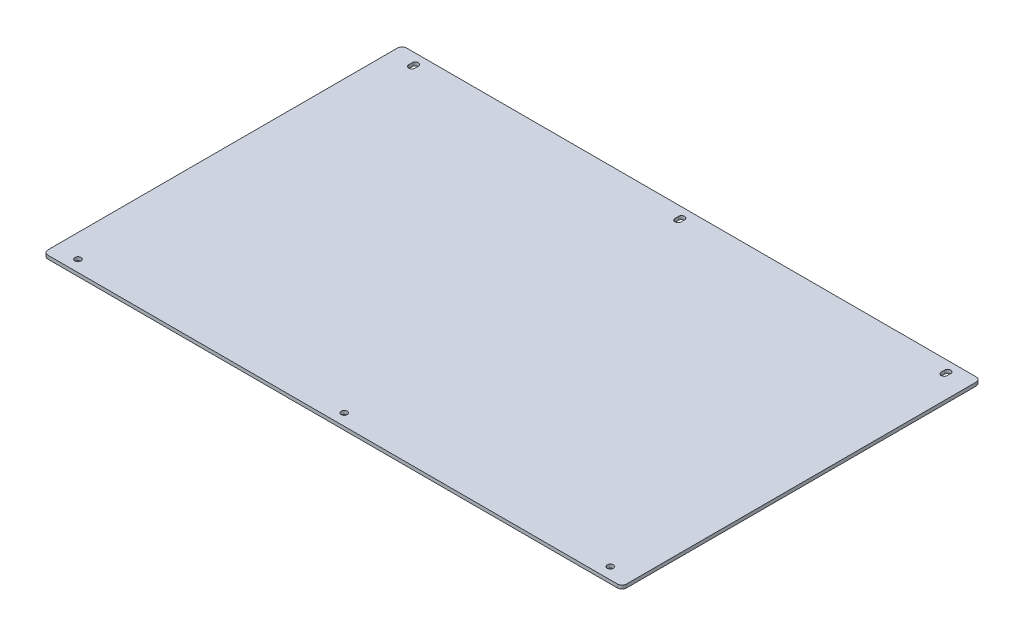
ISO-10303-21;
HEADER;
FILE_DESCRIPTION(('STEP AP214'),'2;1');
FILE_NAME('part.step','',(''),(''),'','','');
FILE_SCHEMA(('AUTOMOTIVE_DESIGN { 1 0 10303 214 1 1 1 1 }'));
ENDSEC;
DATA;
#1=APPLICATION_CONTEXT('core data for automotive mechanical design processes');
#2=APPLICATION_PROTOCOL_DEFINITION('international standard','automotive_design',2000,#1);
#3=PRODUCT_CONTEXT('',#1,'mechanical');
#4=PRODUCT('Part','Part','',(#3));
#5=PRODUCT_RELATED_PRODUCT_CATEGORY('part','',(#4));
#6=PRODUCT_DEFINITION_FORMATION('','',#4);
#7=PRODUCT_DEFINITION_CONTEXT('part definition',#1,'design');
#8=PRODUCT_DEFINITION('design','',#6,#7);
#9=PRODUCT_DEFINITION_SHAPE('','',#8);
#10=(LENGTH_UNIT() NAMED_UNIT(*) SI_UNIT(.MILLI.,.METRE.));
#11=(NAMED_UNIT(*) PLANE_ANGLE_UNIT() SI_UNIT($,.RADIAN.));
#12=(NAMED_UNIT(*) SI_UNIT($,.STERADIAN.) SOLID_ANGLE_UNIT());
#13=UNCERTAINTY_MEASURE_WITH_UNIT(LENGTH_MEASURE(1.E-05),#10,'distance_accuracy_value','');
#14=(GEOMETRIC_REPRESENTATION_CONTEXT(3) GLOBAL_UNCERTAINTY_ASSIGNED_CONTEXT((#13)) GLOBAL_UNIT_ASSIGNED_CONTEXT((#10,
#11,#12)) REPRESENTATION_CONTEXT('',''));
#15=CARTESIAN_POINT('',(0.,0.,0.));
#16=DIRECTION('',(0.,0.,1.));
#17=DIRECTION('',(1.,0.,0.));
#18=AXIS2_PLACEMENT_3D('',#15,#16,#17);
#19=CARTESIAN_POINT('',(250.,3.,155.));
#20=DIRECTION('',(-1.,0.,0.));
#21=DIRECTION('',(0.,0.,1.));
#22=AXIS2_PLACEMENT_3D('',#19,#20,#21);
#23=PLANE('',#22);
#24=DIRECTION('',(0.,0.,-1.));
#25=VECTOR('',#24,1.);
#26=CARTESIAN_POINT('',(250.,0.,155.));
#27=LINE('',#26,#25);
#28=CARTESIAN_POINT('',(250.,0.,151.));
#29=VERTEX_POINT('',#28);
#30=CARTESIAN_POINT('',(250.,0.,-151.));
#31=VERTEX_POINT('',#30);
#32=EDGE_CURVE('E292',#29,#31,#27,.T.);
#33=ORIENTED_EDGE('',*,*,#32,.T.);
#34=DIRECTION('',(0.,-1.,0.));
#35=VECTOR('',#34,1.);
#36=CARTESIAN_POINT('',(250.,3.,-151.));
#37=LINE('',#36,#35);
#38=CARTESIAN_POINT('',(250.,3.,-151.));
#39=VERTEX_POINT('',#38);
#40=EDGE_CURVE('E11',#31,#39,#37,.F.);
#41=ORIENTED_EDGE('',*,*,#40,.T.);
#42=DIRECTION('',(0.,0.,-1.));
#43=VECTOR('',#42,1.);
#44=CARTESIAN_POINT('',(250.,3.,155.));
#45=LINE('',#44,#43);
#46=CARTESIAN_POINT('',(250.,3.,151.));
#47=VERTEX_POINT('',#46);
#48=EDGE_CURVE('E293',#47,#39,#45,.T.);
#49=ORIENTED_EDGE('',*,*,#48,.F.);
#50=DIRECTION('',(0.,-1.,0.));
#51=VECTOR('',#50,1.);
#52=CARTESIAN_POINT('',(250.,3.,151.));
#53=LINE('',#52,#51);
#54=EDGE_CURVE('E41',#47,#29,#53,.T.);
#55=ORIENTED_EDGE('',*,*,#54,.T.);
#56=EDGE_LOOP('',(#33,#41,#49,#55));
#57=FACE_BOUND('',#56,.T.);
#58=ADVANCED_FACE('F33',(#57),#23,.F.);
#59=CARTESIAN_POINT('',(-250.,3.,-155.));
#60=DIRECTION('',(0.,0.,1.));
#61=DIRECTION('',(1.,0.,0.));
#62=AXIS2_PLACEMENT_3D('',#59,#60,#61);
#63=PLANE('',#62);
#64=DIRECTION('',(-1.,0.,0.));
#65=VECTOR('',#64,1.);
#66=CARTESIAN_POINT('',(-250.,0.,-155.));
#67=LINE('',#66,#65);
#68=CARTESIAN_POINT('',(246.,0.,-155.));
#69=VERTEX_POINT('',#68);
#70=CARTESIAN_POINT('',(-246.,0.,-155.));
#71=VERTEX_POINT('',#70);
#72=EDGE_CURVE('E309',#69,#71,#67,.T.);
#73=ORIENTED_EDGE('',*,*,#72,.T.);
#74=DIRECTION('',(0.,-1.,0.));
#75=VECTOR('',#74,1.);
#76=CARTESIAN_POINT('',(-246.,3.,-155.));
#77=LINE('',#76,#75);
#78=CARTESIAN_POINT('',(-246.,3.,-155.));
#79=VERTEX_POINT('',#78);
#80=EDGE_CURVE('E345',#71,#79,#77,.F.);
#81=ORIENTED_EDGE('',*,*,#80,.T.);
#82=DIRECTION('',(-1.,0.,0.));
#83=VECTOR('',#82,1.);
#84=CARTESIAN_POINT('',(-250.,3.,-155.));
#85=LINE('',#84,#83);
#86=CARTESIAN_POINT('',(246.,3.,-155.));
#87=VERTEX_POINT('',#86);
#88=EDGE_CURVE('E296',#87,#79,#85,.T.);
#89=ORIENTED_EDGE('',*,*,#88,.F.);
#90=DIRECTION('',(0.,-1.,0.));
#91=VECTOR('',#90,1.);
#92=CARTESIAN_POINT('',(246.,3.,-155.));
#93=LINE('',#92,#91);
#94=EDGE_CURVE('E342',#87,#69,#93,.T.);
#95=ORIENTED_EDGE('',*,*,#94,.T.);
#96=EDGE_LOOP('',(#73,#81,#89,#95));
#97=FACE_BOUND('',#96,.T.);
#98=ADVANCED_FACE('F363',(#97),#63,.F.);
#99=CARTESIAN_POINT('',(-250.,3.,155.));
#100=DIRECTION('',(1.,0.,0.));
#101=DIRECTION('',(0.,0.,-1.));
#102=AXIS2_PLACEMENT_3D('',#99,#100,#101);
#103=PLANE('',#102);
#104=DIRECTION('',(0.,0.,1.));
#105=VECTOR('',#104,1.);
#106=CARTESIAN_POINT('',(-250.,0.,155.));
#107=LINE('',#106,#105);
#108=CARTESIAN_POINT('',(-250.,0.,-151.));
#109=VERTEX_POINT('',#108);
#110=CARTESIAN_POINT('',(-250.,0.,151.));
#111=VERTEX_POINT('',#110);
#112=EDGE_CURVE('E312',#109,#111,#107,.T.);
#113=ORIENTED_EDGE('',*,*,#112,.T.);
#114=DIRECTION('',(0.,-1.,0.));
#115=VECTOR('',#114,1.);
#116=CARTESIAN_POINT('',(-250.,3.,151.));
#117=LINE('',#116,#115);
#118=CARTESIAN_POINT('',(-250.,3.,151.));
#119=VERTEX_POINT('',#118);
#120=EDGE_CURVE('E332',#111,#119,#117,.F.);
#121=ORIENTED_EDGE('',*,*,#120,.T.);
#122=DIRECTION('',(0.,0.,1.));
#123=VECTOR('',#122,1.);
#124=CARTESIAN_POINT('',(-250.,3.,155.));
#125=LINE('',#124,#123);
#126=CARTESIAN_POINT('',(-250.,3.,-151.));
#127=VERTEX_POINT('',#126);
#128=EDGE_CURVE('E300',#127,#119,#125,.T.);
#129=ORIENTED_EDGE('',*,*,#128,.F.);
#130=DIRECTION('',(0.,-1.,0.));
#131=VECTOR('',#130,1.);
#132=CARTESIAN_POINT('',(-250.,3.,-151.));
#133=LINE('',#132,#131);
#134=EDGE_CURVE('E329',#127,#109,#133,.T.);
#135=ORIENTED_EDGE('',*,*,#134,.T.);
#136=EDGE_LOOP('',(#113,#121,#129,#135));
#137=FACE_BOUND('',#136,.T.);
#138=ADVANCED_FACE('F374',(#137),#103,.F.);
#139=CARTESIAN_POINT('',(-250.,3.,155.));
#140=DIRECTION('',(0.,0.,-1.));
#141=DIRECTION('',(-1.,0.,0.));
#142=AXIS2_PLACEMENT_3D('',#139,#140,#141);
#143=PLANE('',#142);
#144=DIRECTION('',(1.,0.,0.));
#145=VECTOR('',#144,1.);
#146=CARTESIAN_POINT('',(-250.,3.,155.));
#147=LINE('',#146,#145);
#148=CARTESIAN_POINT('',(-246.,3.,155.));
#149=VERTEX_POINT('',#148);
#150=CARTESIAN_POINT('',(246.,3.,155.));
#151=VERTEX_POINT('',#150);
#152=EDGE_CURVE('E303',#149,#151,#147,.T.);
#153=ORIENTED_EDGE('',*,*,#152,.F.);
#154=DIRECTION('',(0.,-1.,0.));
#155=VECTOR('',#154,1.);
#156=CARTESIAN_POINT('',(-246.,3.,155.));
#157=LINE('',#156,#155);
#158=CARTESIAN_POINT('',(-246.,0.,155.));
#159=VERTEX_POINT('',#158);
#160=EDGE_CURVE('E318',#149,#159,#157,.T.);
#161=ORIENTED_EDGE('',*,*,#160,.T.);
#162=DIRECTION('',(1.,0.,0.));
#163=VECTOR('',#162,1.);
#164=CARTESIAN_POINT('',(-250.,0.,155.));
#165=LINE('',#164,#163);
#166=CARTESIAN_POINT('',(246.,0.,155.));
#167=VERTEX_POINT('',#166);
#168=EDGE_CURVE('E297',#159,#167,#165,.T.);
#169=ORIENTED_EDGE('',*,*,#168,.T.);
#170=DIRECTION('',(0.,-1.,0.));
#171=VECTOR('',#170,1.);
#172=CARTESIAN_POINT('',(246.,3.,155.));
#173=LINE('',#172,#171);
#174=EDGE_CURVE('E306',#167,#151,#173,.F.);
#175=ORIENTED_EDGE('',*,*,#174,.T.);
#176=EDGE_LOOP('',(#153,#161,#169,#175));
#177=FACE_BOUND('',#176,.T.);
#178=ADVANCED_FACE('F382',(#177),#143,.F.);
#179=CARTESIAN_POINT('',(0.,3.,0.));
#180=DIRECTION('',(0.,-1.,0.));
#181=DIRECTION('',(0.,0.,-1.));
#182=AXIS2_PLACEMENT_3D('',#179,#180,#181);
#183=PLANE('',#182);
#184=DIRECTION('',(0.,0.,-1.));
#185=VECTOR('',#184,1.);
#186=CARTESIAN_POINT('',(232.65,3.,-143.5));
#187=LINE('',#186,#185);
#188=CARTESIAN_POINT('',(232.65,3.,-143.5));
#189=VERTEX_POINT('',#188);
#190=CARTESIAN_POINT('',(232.65,3.,-146.5));
#191=VERTEX_POINT('',#190);
#192=EDGE_CURVE('E260',#189,#191,#187,.T.);
#193=ORIENTED_EDGE('',*,*,#192,.F.);
#194=CARTESIAN_POINT('',(230.,3.,-143.5));
#195=DIRECTION('',(0.,1.,0.));
#196=DIRECTION('',(0.,0.,1.));
#197=AXIS2_PLACEMENT_3D('',#194,#195,#196);
#198=CIRCLE('',#197,2.64999999999999);
#199=CARTESIAN_POINT('',(227.35,3.,-143.5));
#200=VERTEX_POINT('',#199);
#201=EDGE_CURVE('E257',#200,#189,#198,.T.);
#202=ORIENTED_EDGE('',*,*,#201,.F.);
#203=DIRECTION('',(0.,0.,1.));
#204=VECTOR('',#203,1.);
#205=CARTESIAN_POINT('',(227.35,3.,-143.5));
#206=LINE('',#205,#204);
#207=CARTESIAN_POINT('',(227.35,3.,-146.5));
#208=VERTEX_POINT('',#207);
#209=EDGE_CURVE('E247',#208,#200,#206,.T.);
#210=ORIENTED_EDGE('',*,*,#209,.F.);
#211=CARTESIAN_POINT('',(230.,3.,-146.5));
#212=DIRECTION('',(0.,1.,0.));
#213=DIRECTION('',(0.,0.,1.));
#214=AXIS2_PLACEMENT_3D('',#211,#212,#213);
#215=CIRCLE('',#214,2.64999999999999);
#216=EDGE_CURVE('E262',#191,#208,#215,.T.);
#217=ORIENTED_EDGE('',*,*,#216,.F.);
#218=EDGE_LOOP('',(#193,#202,#210,#217));
#219=FACE_BOUND('',#218,.T.);
#220=CARTESIAN_POINT('',(-230.,3.,145.));
#221=DIRECTION('',(0.,1.,0.));
#222=DIRECTION('',(0.,0.,1.));
#223=AXIS2_PLACEMENT_3D('',#220,#221,#222);
#224=CIRCLE('',#223,2.64999999999999);
#225=CARTESIAN_POINT('',(-230.,3.,147.65));
#226=VERTEX_POINT('',#225);
#227=EDGE_CURVE('E208',#226,#226,#224,.T.);
#228=ORIENTED_EDGE('',*,*,#227,.F.);
#229=EDGE_LOOP('',(#228));
#230=FACE_BOUND('',#229,.T.);
#231=DIRECTION('',(0.,0.,-1.));
#232=VECTOR('',#231,1.);
#233=CARTESIAN_POINT('',(-227.35,3.,-143.5));
#234=LINE('',#233,#232);
#235=CARTESIAN_POINT('',(-227.35,3.,-143.5));
#236=VERTEX_POINT('',#235);
#237=CARTESIAN_POINT('',(-227.35,3.,-146.5));
#238=VERTEX_POINT('',#237);
#239=EDGE_CURVE('E48',#236,#238,#234,.T.);
#240=ORIENTED_EDGE('',*,*,#239,.F.);
#241=CARTESIAN_POINT('',(-230.,3.,-143.5));
#242=DIRECTION('',(0.,1.,0.));
#243=DIRECTION('',(0.,0.,1.));
#244=AXIS2_PLACEMENT_3D('',#241,#242,#243);
#245=CIRCLE('',#244,2.64999999999999);
#246=CARTESIAN_POINT('',(-232.65,3.,-143.5));
#247=VERTEX_POINT('',#246);
#248=EDGE_CURVE('E189',#247,#236,#245,.T.);
#249=ORIENTED_EDGE('',*,*,#248,.F.);
#250=DIRECTION('',(0.,0.,1.));
#251=VECTOR('',#250,1.);
#252=CARTESIAN_POINT('',(-232.65,3.,-143.5));
#253=LINE('',#252,#251);
#254=CARTESIAN_POINT('',(-232.65,3.,-146.5));
#255=VERTEX_POINT('',#254);
#256=EDGE_CURVE('E194',#255,#247,#253,.T.);
#257=ORIENTED_EDGE('',*,*,#256,.F.);
#258=CARTESIAN_POINT('',(-230.,3.,-146.5));
#259=DIRECTION('',(0.,1.,0.));
#260=DIRECTION('',(0.,0.,1.));
#261=AXIS2_PLACEMENT_3D('',#258,#259,#260);
#262=CIRCLE('',#261,2.64999999999999);
#263=EDGE_CURVE('E196',#238,#255,#262,.T.);
#264=ORIENTED_EDGE('',*,*,#263,.F.);
#265=EDGE_LOOP('',(#240,#249,#257,#264));
#266=FACE_BOUND('',#265,.T.);
#267=CARTESIAN_POINT('',(230.,3.,145.));
#268=DIRECTION('',(0.,1.,0.));
#269=DIRECTION('',(0.,0.,1.));
#270=AXIS2_PLACEMENT_3D('',#267,#268,#269);
#271=CIRCLE('',#270,2.64999999999999);
#272=CARTESIAN_POINT('',(230.,3.,147.65));
#273=VERTEX_POINT('',#272);
#274=EDGE_CURVE('E280',#273,#273,#271,.T.);
#275=ORIENTED_EDGE('',*,*,#274,.F.);
#276=EDGE_LOOP('',(#275));
#277=FACE_BOUND('',#276,.T.);
#278=DIRECTION('',(0.,0.,-1.));
#279=VECTOR('',#278,1.);
#280=CARTESIAN_POINT('',(2.65000000000007,3.,-143.5));
#281=LINE('',#280,#279);
#282=CARTESIAN_POINT('',(2.65000000000007,3.,-143.5));
#283=VERTEX_POINT('',#282);
#284=CARTESIAN_POINT('',(2.65000000000007,3.,-146.5));
#285=VERTEX_POINT('',#284);
#286=EDGE_CURVE('E56',#283,#285,#281,.T.);
#287=ORIENTED_EDGE('',*,*,#286,.F.);
#288=CARTESIAN_POINT('',(0.,3.,-143.5));
#289=DIRECTION('',(0.,1.,0.));
#290=DIRECTION('',(0.,0.,1.));
#291=AXIS2_PLACEMENT_3D('',#288,#289,#290);
#292=CIRCLE('',#291,2.64999999999999);
#293=CARTESIAN_POINT('',(-2.6499999999999,3.,-143.5));
#294=VERTEX_POINT('',#293);
#295=EDGE_CURVE('E226',#294,#283,#292,.T.);
#296=ORIENTED_EDGE('',*,*,#295,.F.);
#297=DIRECTION('',(0.,0.,1.));
#298=VECTOR('',#297,1.);
#299=CARTESIAN_POINT('',(-2.6499999999999,3.,-143.5));
#300=LINE('',#299,#298);
#301=CARTESIAN_POINT('',(-2.6499999999999,3.,-146.5));
#302=VERTEX_POINT('',#301);
#303=EDGE_CURVE('E216',#302,#294,#300,.T.);
#304=ORIENTED_EDGE('',*,*,#303,.F.);
#305=CARTESIAN_POINT('',(0.,3.,-146.5));
#306=DIRECTION('',(0.,1.,0.));
#307=DIRECTION('',(0.,0.,1.));
#308=AXIS2_PLACEMENT_3D('',#305,#306,#307);
#309=CIRCLE('',#308,2.64999999999999);
#310=EDGE_CURVE('E230',#285,#302,#309,.T.);
#311=ORIENTED_EDGE('',*,*,#310,.F.);
#312=EDGE_LOOP('',(#287,#296,#304,#311));
#313=FACE_BOUND('',#312,.T.);
#314=CARTESIAN_POINT('',(0.,3.,145.));
#315=DIRECTION('',(0.,1.,0.));
#316=DIRECTION('',(0.,0.,1.));
#317=AXIS2_PLACEMENT_3D('',#314,#315,#316);
#318=CIRCLE('',#317,2.65);
#319=CARTESIAN_POINT('',(0.,3.,147.65));
#320=VERTEX_POINT('',#319);
#321=EDGE_CURVE('E286',#320,#320,#318,.T.);
#322=ORIENTED_EDGE('',*,*,#321,.F.);
#323=EDGE_LOOP('',(#322));
#324=FACE_BOUND('',#323,.T.);
#325=ORIENTED_EDGE('',*,*,#128,.T.);
#326=CARTESIAN_POINT('',(-246.,3.,151.));
#327=DIRECTION('',(0.,-1.,0.));
#328=DIRECTION('',(0.,0.,-1.));
#329=AXIS2_PLACEMENT_3D('',#326,#327,#328);
#330=CIRCLE('',#329,4.);
#331=EDGE_CURVE('E340',#119,#149,#330,.F.);
#332=ORIENTED_EDGE('',*,*,#331,.T.);
#333=ORIENTED_EDGE('',*,*,#152,.T.);
#334=CARTESIAN_POINT('',(246.,3.,151.));
#335=DIRECTION('',(0.,-1.,0.));
#336=DIRECTION('',(0.,0.,-1.));
#337=AXIS2_PLACEMENT_3D('',#334,#335,#336);
#338=CIRCLE('',#337,4.);
#339=EDGE_CURVE('E334',#151,#47,#338,.F.);
#340=ORIENTED_EDGE('',*,*,#339,.T.);
#341=ORIENTED_EDGE('',*,*,#48,.T.);
#342=CARTESIAN_POINT('',(246.,3.,-151.));
#343=DIRECTION('',(0.,-1.,0.));
#344=DIRECTION('',(0.,0.,-1.));
#345=AXIS2_PLACEMENT_3D('',#342,#343,#344);
#346=CIRCLE('',#345,4.);
#347=EDGE_CURVE('E336',#39,#87,#346,.F.);
#348=ORIENTED_EDGE('',*,*,#347,.T.);
#349=ORIENTED_EDGE('',*,*,#88,.T.);
#350=CARTESIAN_POINT('',(-246.,3.,-151.));
#351=DIRECTION('',(0.,-1.,0.));
#352=DIRECTION('',(0.,0.,-1.));
#353=AXIS2_PLACEMENT_3D('',#350,#351,#352);
#354=CIRCLE('',#353,4.);
#355=EDGE_CURVE('E338',#79,#127,#354,.F.);
#356=ORIENTED_EDGE('',*,*,#355,.T.);
#357=EDGE_LOOP('',(#325,#332,#333,#340,#341,#348,#349,#356));
#358=FACE_BOUND('',#357,.T.);
#359=ADVANCED_FACE('F367',(#219,#230,#266,#277,#313,#324,#358),#183,.F.);
#360=CARTESIAN_POINT('',(0.,0.,0.));
#361=DIRECTION('',(0.,-1.,0.));
#362=DIRECTION('',(0.,0.,-1.));
#363=AXIS2_PLACEMENT_3D('',#360,#361,#362);
#364=PLANE('',#363);
#365=CARTESIAN_POINT('',(-230.,0.,-143.5));
#366=DIRECTION('',(0.,1.,0.));
#367=DIRECTION('',(0.,0.,1.));
#368=AXIS2_PLACEMENT_3D('',#365,#366,#367);
#369=CIRCLE('',#368,2.64999999999999);
#370=CARTESIAN_POINT('',(-232.65,0.,-143.5));
#371=VERTEX_POINT('',#370);
#372=CARTESIAN_POINT('',(-227.35,0.,-143.5));
#373=VERTEX_POINT('',#372);
#374=EDGE_CURVE('E182',#371,#373,#369,.T.);
#375=ORIENTED_EDGE('',*,*,#374,.T.);
#376=DIRECTION('',(0.,0.,-1.));
#377=VECTOR('',#376,1.);
#378=CARTESIAN_POINT('',(-227.35,0.,-143.5));
#379=LINE('',#378,#377);
#380=CARTESIAN_POINT('',(-227.35,0.,-146.5));
#381=VERTEX_POINT('',#380);
#382=EDGE_CURVE('E171',#373,#381,#379,.T.);
#383=ORIENTED_EDGE('',*,*,#382,.T.);
#384=CARTESIAN_POINT('',(-230.,0.,-146.5));
#385=DIRECTION('',(0.,1.,0.));
#386=DIRECTION('',(0.,0.,1.));
#387=AXIS2_PLACEMENT_3D('',#384,#385,#386);
#388=CIRCLE('',#387,2.64999999999999);
#389=CARTESIAN_POINT('',(-232.65,0.,-146.5));
#390=VERTEX_POINT('',#389);
#391=EDGE_CURVE('E181',#381,#390,#388,.T.);
#392=ORIENTED_EDGE('',*,*,#391,.T.);
#393=DIRECTION('',(0.,0.,1.));
#394=VECTOR('',#393,1.);
#395=CARTESIAN_POINT('',(-232.65,0.,-143.5));
#396=LINE('',#395,#394);
#397=EDGE_CURVE('E190',#390,#371,#396,.T.);
#398=ORIENTED_EDGE('',*,*,#397,.T.);
#399=EDGE_LOOP('',(#375,#383,#392,#398));
#400=FACE_BOUND('',#399,.T.);
#401=CARTESIAN_POINT('',(0.,0.,-143.5));
#402=DIRECTION('',(0.,1.,0.));
#403=DIRECTION('',(0.,0.,1.));
#404=AXIS2_PLACEMENT_3D('',#401,#402,#403);
#405=CIRCLE('',#404,2.64999999999999);
#406=CARTESIAN_POINT('',(-2.6499999999999,0.,-143.5));
#407=VERTEX_POINT('',#406);
#408=CARTESIAN_POINT('',(2.65000000000007,0.,-143.5));
#409=VERTEX_POINT('',#408);
#410=EDGE_CURVE('E212',#407,#409,#405,.T.);
#411=ORIENTED_EDGE('',*,*,#410,.T.);
#412=DIRECTION('',(0.,0.,-1.));
#413=VECTOR('',#412,1.);
#414=CARTESIAN_POINT('',(2.65000000000007,0.,-143.5));
#415=LINE('',#414,#413);
#416=CARTESIAN_POINT('',(2.65000000000007,0.,-146.5));
#417=VERTEX_POINT('',#416);
#418=EDGE_CURVE('E215',#409,#417,#415,.T.);
#419=ORIENTED_EDGE('',*,*,#418,.T.);
#420=CARTESIAN_POINT('',(0.,0.,-146.5));
#421=DIRECTION('',(0.,1.,0.));
#422=DIRECTION('',(0.,0.,1.));
#423=AXIS2_PLACEMENT_3D('',#420,#421,#422);
#424=CIRCLE('',#423,2.64999999999999);
#425=CARTESIAN_POINT('',(-2.6499999999999,0.,-146.5));
#426=VERTEX_POINT('',#425);
#427=EDGE_CURVE('E219',#417,#426,#424,.T.);
#428=ORIENTED_EDGE('',*,*,#427,.T.);
#429=DIRECTION('',(0.,0.,1.));
#430=VECTOR('',#429,1.);
#431=CARTESIAN_POINT('',(-2.6499999999999,0.,-143.5));
#432=LINE('',#431,#430);
#433=EDGE_CURVE('E222',#426,#407,#432,.T.);
#434=ORIENTED_EDGE('',*,*,#433,.T.);
#435=EDGE_LOOP('',(#411,#419,#428,#434));
#436=FACE_BOUND('',#435,.T.);
#437=CARTESIAN_POINT('',(230.,0.,-143.5));
#438=DIRECTION('',(0.,1.,0.));
#439=DIRECTION('',(0.,0.,1.));
#440=AXIS2_PLACEMENT_3D('',#437,#438,#439);
#441=CIRCLE('',#440,2.64999999999999);
#442=CARTESIAN_POINT('',(227.35,0.,-143.5));
#443=VERTEX_POINT('',#442);
#444=CARTESIAN_POINT('',(232.65,0.,-143.5));
#445=VERTEX_POINT('',#444);
#446=EDGE_CURVE('E243',#443,#445,#441,.T.);
#447=ORIENTED_EDGE('',*,*,#446,.T.);
#448=DIRECTION('',(0.,0.,-1.));
#449=VECTOR('',#448,1.);
#450=CARTESIAN_POINT('',(232.65,0.,-143.5));
#451=LINE('',#450,#449);
#452=CARTESIAN_POINT('',(232.65,0.,-146.5));
#453=VERTEX_POINT('',#452);
#454=EDGE_CURVE('E246',#445,#453,#451,.T.);
#455=ORIENTED_EDGE('',*,*,#454,.T.);
#456=CARTESIAN_POINT('',(230.,0.,-146.5));
#457=DIRECTION('',(0.,1.,0.));
#458=DIRECTION('',(0.,0.,1.));
#459=AXIS2_PLACEMENT_3D('',#456,#457,#458);
#460=CIRCLE('',#459,2.64999999999999);
#461=CARTESIAN_POINT('',(227.35,0.,-146.5));
#462=VERTEX_POINT('',#461);
#463=EDGE_CURVE('E250',#453,#462,#460,.T.);
#464=ORIENTED_EDGE('',*,*,#463,.T.);
#465=DIRECTION('',(0.,0.,1.));
#466=VECTOR('',#465,1.);
#467=CARTESIAN_POINT('',(227.35,0.,-143.5));
#468=LINE('',#467,#466);
#469=EDGE_CURVE('E253',#462,#443,#468,.T.);
#470=ORIENTED_EDGE('',*,*,#469,.T.);
#471=EDGE_LOOP('',(#447,#455,#464,#470));
#472=FACE_BOUND('',#471,.T.);
#473=CARTESIAN_POINT('',(-230.,0.,145.));
#474=DIRECTION('',(0.,1.,0.));
#475=DIRECTION('',(0.,0.,1.));
#476=AXIS2_PLACEMENT_3D('',#473,#474,#475);
#477=CIRCLE('',#476,2.64999999999999);
#478=CARTESIAN_POINT('',(-230.,0.,147.65));
#479=VERTEX_POINT('',#478);
#480=EDGE_CURVE('E277',#479,#479,#477,.T.);
#481=ORIENTED_EDGE('',*,*,#480,.T.);
#482=EDGE_LOOP('',(#481));
#483=FACE_BOUND('',#482,.T.);
#484=CARTESIAN_POINT('',(230.,0.,145.));
#485=DIRECTION('',(0.,1.,0.));
#486=DIRECTION('',(0.,0.,1.));
#487=AXIS2_PLACEMENT_3D('',#484,#485,#486);
#488=CIRCLE('',#487,2.64999999999999);
#489=CARTESIAN_POINT('',(230.,0.,147.65));
#490=VERTEX_POINT('',#489);
#491=EDGE_CURVE('E283',#490,#490,#488,.T.);
#492=ORIENTED_EDGE('',*,*,#491,.T.);
#493=EDGE_LOOP('',(#492));
#494=FACE_BOUND('',#493,.T.);
#495=CARTESIAN_POINT('',(0.,0.,145.));
#496=DIRECTION('',(0.,1.,0.));
#497=DIRECTION('',(0.,0.,1.));
#498=AXIS2_PLACEMENT_3D('',#495,#496,#497);
#499=CIRCLE('',#498,2.65);
#500=CARTESIAN_POINT('',(0.,0.,147.65));
#501=VERTEX_POINT('',#500);
#502=EDGE_CURVE('E289',#501,#501,#499,.T.);
#503=ORIENTED_EDGE('',*,*,#502,.T.);
#504=EDGE_LOOP('',(#503));
#505=FACE_BOUND('',#504,.T.);
#506=ORIENTED_EDGE('',*,*,#168,.F.);
#507=CARTESIAN_POINT('',(-246.,0.,151.));
#508=DIRECTION('',(0.,-1.,0.));
#509=DIRECTION('',(0.,0.,-1.));
#510=AXIS2_PLACEMENT_3D('',#507,#508,#509);
#511=CIRCLE('',#510,4.);
#512=EDGE_CURVE('E327',#159,#111,#511,.T.);
#513=ORIENTED_EDGE('',*,*,#512,.T.);
#514=ORIENTED_EDGE('',*,*,#112,.F.);
#515=CARTESIAN_POINT('',(-246.,0.,-151.));
#516=DIRECTION('',(0.,-1.,0.));
#517=DIRECTION('',(0.,0.,-1.));
#518=AXIS2_PLACEMENT_3D('',#515,#516,#517);
#519=CIRCLE('',#518,4.);
#520=EDGE_CURVE('E325',#109,#71,#519,.T.);
#521=ORIENTED_EDGE('',*,*,#520,.T.);
#522=ORIENTED_EDGE('',*,*,#72,.F.);
#523=CARTESIAN_POINT('',(246.,0.,-151.));
#524=DIRECTION('',(0.,-1.,0.));
#525=DIRECTION('',(0.,0.,-1.));
#526=AXIS2_PLACEMENT_3D('',#523,#524,#525);
#527=CIRCLE('',#526,4.);
#528=EDGE_CURVE('E323',#69,#31,#527,.T.);
#529=ORIENTED_EDGE('',*,*,#528,.T.);
#530=ORIENTED_EDGE('',*,*,#32,.F.);
#531=CARTESIAN_POINT('',(246.,0.,151.));
#532=DIRECTION('',(0.,-1.,0.));
#533=DIRECTION('',(0.,0.,-1.));
#534=AXIS2_PLACEMENT_3D('',#531,#532,#533);
#535=CIRCLE('',#534,4.);
#536=EDGE_CURVE('E321',#29,#167,#535,.T.);
#537=ORIENTED_EDGE('',*,*,#536,.T.);
#538=EDGE_LOOP('',(#506,#513,#514,#521,#522,#529,#530,#537));
#539=FACE_BOUND('',#538,.T.);
#540=ADVANCED_FACE('F192',(#400,#436,#472,#483,#494,#505,#539),#364,.T.);
#541=CARTESIAN_POINT('',(-246.,3.,151.));
#542=DIRECTION('',(0.,-1.,0.));
#543=DIRECTION('',(0.,0.,-1.));
#544=AXIS2_PLACEMENT_3D('',#541,#542,#543);
#545=CYLINDRICAL_SURFACE('',#544,4.);
#546=ORIENTED_EDGE('',*,*,#331,.F.);
#547=ORIENTED_EDGE('',*,*,#120,.F.);
#548=ORIENTED_EDGE('',*,*,#512,.F.);
#549=ORIENTED_EDGE('',*,*,#160,.F.);
#550=EDGE_LOOP('',(#546,#547,#548,#549));
#551=FACE_BOUND('',#550,.T.);
#552=ADVANCED_FACE('F379',(#551),#545,.T.);
#553=CARTESIAN_POINT('',(-246.,3.,-151.));
#554=DIRECTION('',(0.,-1.,0.));
#555=DIRECTION('',(0.,0.,-1.));
#556=AXIS2_PLACEMENT_3D('',#553,#554,#555);
#557=CYLINDRICAL_SURFACE('',#556,4.);
#558=ORIENTED_EDGE('',*,*,#355,.F.);
#559=ORIENTED_EDGE('',*,*,#80,.F.);
#560=ORIENTED_EDGE('',*,*,#520,.F.);
#561=ORIENTED_EDGE('',*,*,#134,.F.);
#562=EDGE_LOOP('',(#558,#559,#560,#561));
#563=FACE_BOUND('',#562,.T.);
#564=ADVANCED_FACE('F371',(#563),#557,.T.);
#565=CARTESIAN_POINT('',(246.,3.,-151.));
#566=DIRECTION('',(0.,-1.,0.));
#567=DIRECTION('',(0.,0.,-1.));
#568=AXIS2_PLACEMENT_3D('',#565,#566,#567);
#569=CYLINDRICAL_SURFACE('',#568,4.);
#570=ORIENTED_EDGE('',*,*,#347,.F.);
#571=ORIENTED_EDGE('',*,*,#40,.F.);
#572=ORIENTED_EDGE('',*,*,#528,.F.);
#573=ORIENTED_EDGE('',*,*,#94,.F.);
#574=EDGE_LOOP('',(#570,#571,#572,#573));
#575=FACE_BOUND('',#574,.T.);
#576=ADVANCED_FACE('F360',(#575),#569,.T.);
#577=CARTESIAN_POINT('',(246.,3.,151.));
#578=DIRECTION('',(0.,-1.,0.));
#579=DIRECTION('',(0.,0.,-1.));
#580=AXIS2_PLACEMENT_3D('',#577,#578,#579);
#581=CYLINDRICAL_SURFACE('',#580,4.);
#582=ORIENTED_EDGE('',*,*,#339,.F.);
#583=ORIENTED_EDGE('',*,*,#174,.F.);
#584=ORIENTED_EDGE('',*,*,#536,.F.);
#585=ORIENTED_EDGE('',*,*,#54,.F.);
#586=EDGE_LOOP('',(#582,#583,#584,#585));
#587=FACE_BOUND('',#586,.T.);
#588=ADVANCED_FACE('F35',(#587),#581,.T.);
#589=CARTESIAN_POINT('',(0.,3.,145.));
#590=DIRECTION('',(0.,1.,0.));
#591=DIRECTION('',(0.,0.,1.));
#592=AXIS2_PLACEMENT_3D('',#589,#590,#591);
#593=CYLINDRICAL_SURFACE('',#592,2.65);
#594=ORIENTED_EDGE('',*,*,#502,.F.);
#595=EDGE_LOOP('',(#594));
#596=FACE_BOUND('',#595,.T.);
#597=ORIENTED_EDGE('',*,*,#321,.T.);
#598=EDGE_LOOP('',(#597));
#599=FACE_BOUND('',#598,.T.);
#600=ADVANCED_FACE('F385',(#596,#599),#593,.F.);
#601=CARTESIAN_POINT('',(230.,3.,145.));
#602=DIRECTION('',(0.,1.,0.));
#603=DIRECTION('',(0.,0.,1.));
#604=AXIS2_PLACEMENT_3D('',#601,#602,#603);
#605=CYLINDRICAL_SURFACE('',#604,2.64999999999999);
#606=ORIENTED_EDGE('',*,*,#491,.F.);
#607=EDGE_LOOP('',(#606));
#608=FACE_BOUND('',#607,.T.);
#609=ORIENTED_EDGE('',*,*,#274,.T.);
#610=EDGE_LOOP('',(#609));
#611=FACE_BOUND('',#610,.T.);
#612=ADVANCED_FACE('F390',(#608,#611),#605,.F.);
#613=CARTESIAN_POINT('',(-230.,3.,145.));
#614=DIRECTION('',(0.,1.,0.));
#615=DIRECTION('',(0.,0.,1.));
#616=AXIS2_PLACEMENT_3D('',#613,#614,#615);
#617=CYLINDRICAL_SURFACE('',#616,2.64999999999999);
#618=ORIENTED_EDGE('',*,*,#480,.F.);
#619=EDGE_LOOP('',(#618));
#620=FACE_BOUND('',#619,.T.);
#621=ORIENTED_EDGE('',*,*,#227,.T.);
#622=EDGE_LOOP('',(#621));
#623=FACE_BOUND('',#622,.T.);
#624=ADVANCED_FACE('F432',(#620,#623),#617,.F.);
#625=CARTESIAN_POINT('',(227.35,0.,-143.5));
#626=DIRECTION('',(-1.,0.,0.));
#627=DIRECTION('',(0.,0.,1.));
#628=AXIS2_PLACEMENT_3D('',#625,#626,#627);
#629=PLANE('',#628);
#630=ORIENTED_EDGE('',*,*,#209,.T.);
#631=DIRECTION('',(0.,1.,0.));
#632=VECTOR('',#631,1.);
#633=CARTESIAN_POINT('',(227.35,0.,-143.5));
#634=LINE('',#633,#632);
#635=EDGE_CURVE('E228',#443,#200,#634,.T.);
#636=ORIENTED_EDGE('',*,*,#635,.F.);
#637=ORIENTED_EDGE('',*,*,#469,.F.);
#638=DIRECTION('',(0.,1.,0.));
#639=VECTOR('',#638,1.);
#640=CARTESIAN_POINT('',(227.35,0.,-146.5));
#641=LINE('',#640,#639);
#642=EDGE_CURVE('E268',#462,#208,#641,.T.);
#643=ORIENTED_EDGE('',*,*,#642,.T.);
#644=EDGE_LOOP('',(#630,#636,#637,#643));
#645=FACE_BOUND('',#644,.T.);
#646=ADVANCED_FACE('F442',(#645),#629,.F.);
#647=CARTESIAN_POINT('',(232.65,0.,-143.5));
#648=DIRECTION('',(1.,0.,0.));
#649=DIRECTION('',(0.,0.,-1.));
#650=AXIS2_PLACEMENT_3D('',#647,#648,#649);
#651=PLANE('',#650);
#652=ORIENTED_EDGE('',*,*,#192,.T.);
#653=DIRECTION('',(0.,1.,0.));
#654=VECTOR('',#653,1.);
#655=CARTESIAN_POINT('',(232.65,0.,-146.5));
#656=LINE('',#655,#654);
#657=EDGE_CURVE('E270',#453,#191,#656,.T.);
#658=ORIENTED_EDGE('',*,*,#657,.F.);
#659=ORIENTED_EDGE('',*,*,#454,.F.);
#660=DIRECTION('',(0.,1.,0.));
#661=VECTOR('',#660,1.);
#662=CARTESIAN_POINT('',(232.65,0.,-143.5));
#663=LINE('',#662,#661);
#664=EDGE_CURVE('E256',#445,#189,#663,.T.);
#665=ORIENTED_EDGE('',*,*,#664,.T.);
#666=EDGE_LOOP('',(#652,#658,#659,#665));
#667=FACE_BOUND('',#666,.T.);
#668=ADVANCED_FACE('F465',(#667),#651,.F.);
#669=CARTESIAN_POINT('',(230.,0.,-143.5));
#670=DIRECTION('',(0.,1.,0.));
#671=DIRECTION('',(0.,0.,1.));
#672=AXIS2_PLACEMENT_3D('',#669,#670,#671);
#673=CYLINDRICAL_SURFACE('',#672,2.64999999999999);
#674=ORIENTED_EDGE('',*,*,#201,.T.);
#675=ORIENTED_EDGE('',*,*,#664,.F.);
#676=ORIENTED_EDGE('',*,*,#446,.F.);
#677=ORIENTED_EDGE('',*,*,#635,.T.);
#678=EDGE_LOOP('',(#674,#675,#676,#677));
#679=FACE_BOUND('',#678,.T.);
#680=ADVANCED_FACE('F475',(#679),#673,.F.);
#681=CARTESIAN_POINT('',(230.,0.,-146.5));
#682=DIRECTION('',(0.,1.,0.));
#683=DIRECTION('',(0.,0.,1.));
#684=AXIS2_PLACEMENT_3D('',#681,#682,#683);
#685=CYLINDRICAL_SURFACE('',#684,2.64999999999999);
#686=ORIENTED_EDGE('',*,*,#216,.T.);
#687=ORIENTED_EDGE('',*,*,#642,.F.);
#688=ORIENTED_EDGE('',*,*,#463,.F.);
#689=ORIENTED_EDGE('',*,*,#657,.T.);
#690=EDGE_LOOP('',(#686,#687,#688,#689));
#691=FACE_BOUND('',#690,.T.);
#692=ADVANCED_FACE('F485',(#691),#685,.F.);
#693=CARTESIAN_POINT('',(-2.6499999999999,0.,-143.5));
#694=DIRECTION('',(-1.,0.,0.));
#695=DIRECTION('',(0.,0.,1.));
#696=AXIS2_PLACEMENT_3D('',#693,#694,#695);
#697=PLANE('',#696);
#698=ORIENTED_EDGE('',*,*,#303,.T.);
#699=DIRECTION('',(0.,1.,0.));
#700=VECTOR('',#699,1.);
#701=CARTESIAN_POINT('',(-2.6499999999999,0.,-143.5));
#702=LINE('',#701,#700);
#703=EDGE_CURVE('E202',#407,#294,#702,.T.);
#704=ORIENTED_EDGE('',*,*,#703,.F.);
#705=ORIENTED_EDGE('',*,*,#433,.F.);
#706=DIRECTION('',(0.,1.,0.));
#707=VECTOR('',#706,1.);
#708=CARTESIAN_POINT('',(-2.6499999999999,0.,-146.5));
#709=LINE('',#708,#707);
#710=EDGE_CURVE('E236',#426,#302,#709,.T.);
#711=ORIENTED_EDGE('',*,*,#710,.T.);
#712=EDGE_LOOP('',(#698,#704,#705,#711));
#713=FACE_BOUND('',#712,.T.);
#714=ADVANCED_FACE('F495',(#713),#697,.F.);
#715=CARTESIAN_POINT('',(2.65000000000007,0.,-143.5));
#716=DIRECTION('',(1.,0.,0.));
#717=DIRECTION('',(0.,0.,-1.));
#718=AXIS2_PLACEMENT_3D('',#715,#716,#717);
#719=PLANE('',#718);
#720=ORIENTED_EDGE('',*,*,#286,.T.);
#721=DIRECTION('',(0.,1.,0.));
#722=VECTOR('',#721,1.);
#723=CARTESIAN_POINT('',(2.65000000000007,0.,-146.5));
#724=LINE('',#723,#722);
#725=EDGE_CURVE('E238',#417,#285,#724,.T.);
#726=ORIENTED_EDGE('',*,*,#725,.F.);
#727=ORIENTED_EDGE('',*,*,#418,.F.);
#728=DIRECTION('',(0.,1.,0.));
#729=VECTOR('',#728,1.);
#730=CARTESIAN_POINT('',(2.65000000000007,0.,-143.5));
#731=LINE('',#730,#729);
#732=EDGE_CURVE('E225',#409,#283,#731,.T.);
#733=ORIENTED_EDGE('',*,*,#732,.T.);
#734=EDGE_LOOP('',(#720,#726,#727,#733));
#735=FACE_BOUND('',#734,.T.);
#736=ADVANCED_FACE('F505',(#735),#719,.F.);
#737=CARTESIAN_POINT('',(0.,0.,-143.5));
#738=DIRECTION('',(0.,1.,0.));
#739=DIRECTION('',(0.,0.,1.));
#740=AXIS2_PLACEMENT_3D('',#737,#738,#739);
#741=CYLINDRICAL_SURFACE('',#740,2.64999999999999);
#742=ORIENTED_EDGE('',*,*,#295,.T.);
#743=ORIENTED_EDGE('',*,*,#732,.F.);
#744=ORIENTED_EDGE('',*,*,#410,.F.);
#745=ORIENTED_EDGE('',*,*,#703,.T.);
#746=EDGE_LOOP('',(#742,#743,#744,#745));
#747=FACE_BOUND('',#746,.T.);
#748=ADVANCED_FACE('F515',(#747),#741,.F.);
#749=CARTESIAN_POINT('',(0.,0.,-146.5));
#750=DIRECTION('',(0.,1.,0.));
#751=DIRECTION('',(0.,0.,1.));
#752=AXIS2_PLACEMENT_3D('',#749,#750,#751);
#753=CYLINDRICAL_SURFACE('',#752,2.64999999999999);
#754=ORIENTED_EDGE('',*,*,#310,.T.);
#755=ORIENTED_EDGE('',*,*,#710,.F.);
#756=ORIENTED_EDGE('',*,*,#427,.F.);
#757=ORIENTED_EDGE('',*,*,#725,.T.);
#758=EDGE_LOOP('',(#754,#755,#756,#757));
#759=FACE_BOUND('',#758,.T.);
#760=ADVANCED_FACE('F525',(#759),#753,.F.);
#761=CARTESIAN_POINT('',(-232.65,0.,-143.5));
#762=DIRECTION('',(-1.,0.,0.));
#763=DIRECTION('',(0.,0.,1.));
#764=AXIS2_PLACEMENT_3D('',#761,#762,#763);
#765=PLANE('',#764);
#766=ORIENTED_EDGE('',*,*,#256,.T.);
#767=DIRECTION('',(0.,1.,0.));
#768=VECTOR('',#767,1.);
#769=CARTESIAN_POINT('',(-232.65,0.,-143.5));
#770=LINE('',#769,#768);
#771=EDGE_CURVE('E206',#371,#247,#770,.T.);
#772=ORIENTED_EDGE('',*,*,#771,.F.);
#773=ORIENTED_EDGE('',*,*,#397,.F.);
#774=DIRECTION('',(0.,1.,0.));
#775=VECTOR('',#774,1.);
#776=CARTESIAN_POINT('',(-232.65,0.,-146.5));
#777=LINE('',#776,#775);
#778=EDGE_CURVE('E209',#390,#255,#777,.T.);
#779=ORIENTED_EDGE('',*,*,#778,.T.);
#780=EDGE_LOOP('',(#766,#772,#773,#779));
#781=FACE_BOUND('',#780,.T.);
#782=ADVANCED_FACE('F535',(#781),#765,.F.);
#783=CARTESIAN_POINT('',(-227.35,0.,-143.5));
#784=DIRECTION('',(1.,0.,0.));
#785=DIRECTION('',(0.,0.,-1.));
#786=AXIS2_PLACEMENT_3D('',#783,#784,#785);
#787=PLANE('',#786);
#788=ORIENTED_EDGE('',*,*,#239,.T.);
#789=DIRECTION('',(0.,1.,0.));
#790=VECTOR('',#789,1.);
#791=CARTESIAN_POINT('',(-227.35,0.,-146.5));
#792=LINE('',#791,#790);
#793=EDGE_CURVE('E176',#381,#238,#792,.T.);
#794=ORIENTED_EDGE('',*,*,#793,.F.);
#795=ORIENTED_EDGE('',*,*,#382,.F.);
#796=DIRECTION('',(0.,1.,0.));
#797=VECTOR('',#796,1.);
#798=CARTESIAN_POINT('',(-227.35,0.,-143.5));
#799=LINE('',#798,#797);
#800=EDGE_CURVE('E174',#373,#236,#799,.T.);
#801=ORIENTED_EDGE('',*,*,#800,.T.);
#802=EDGE_LOOP('',(#788,#794,#795,#801));
#803=FACE_BOUND('',#802,.T.);
#804=ADVANCED_FACE('F173',(#803),#787,.F.);
#805=CARTESIAN_POINT('',(-230.,0.,-143.5));
#806=DIRECTION('',(0.,1.,0.));
#807=DIRECTION('',(0.,0.,1.));
#808=AXIS2_PLACEMENT_3D('',#805,#806,#807);
#809=CYLINDRICAL_SURFACE('',#808,2.64999999999999);
#810=ORIENTED_EDGE('',*,*,#248,.T.);
#811=ORIENTED_EDGE('',*,*,#800,.F.);
#812=ORIENTED_EDGE('',*,*,#374,.F.);
#813=ORIENTED_EDGE('',*,*,#771,.T.);
#814=EDGE_LOOP('',(#810,#811,#812,#813));
#815=FACE_BOUND('',#814,.T.);
#816=ADVANCED_FACE('F186',(#815),#809,.F.);
#817=CARTESIAN_POINT('',(-230.,0.,-146.5));
#818=DIRECTION('',(0.,1.,0.));
#819=DIRECTION('',(0.,0.,1.));
#820=AXIS2_PLACEMENT_3D('',#817,#818,#819);
#821=CYLINDRICAL_SURFACE('',#820,2.64999999999999);
#822=ORIENTED_EDGE('',*,*,#263,.T.);
#823=ORIENTED_EDGE('',*,*,#778,.F.);
#824=ORIENTED_EDGE('',*,*,#391,.F.);
#825=ORIENTED_EDGE('',*,*,#793,.T.);
#826=EDGE_LOOP('',(#822,#823,#824,#825));
#827=FACE_BOUND('',#826,.T.);
#828=ADVANCED_FACE('F562',(#827),#821,.F.);
#829=CLOSED_SHELL('',(#58,#98,#138,#178,#359,#540,#552,#564,#576,#588,#600,#612,#624,#646,#668,
#680,#692,#714,#736,#748,#760,#782,#804,#816,#828));
#830=MANIFOLD_SOLID_BREP('B2',#829);
#831=ADVANCED_BREP_SHAPE_REPRESENTATION('',(#18,#830),#14);
#832=SHAPE_DEFINITION_REPRESENTATION(#9,#831);
ENDSEC;
END-ISO-10303-21;
